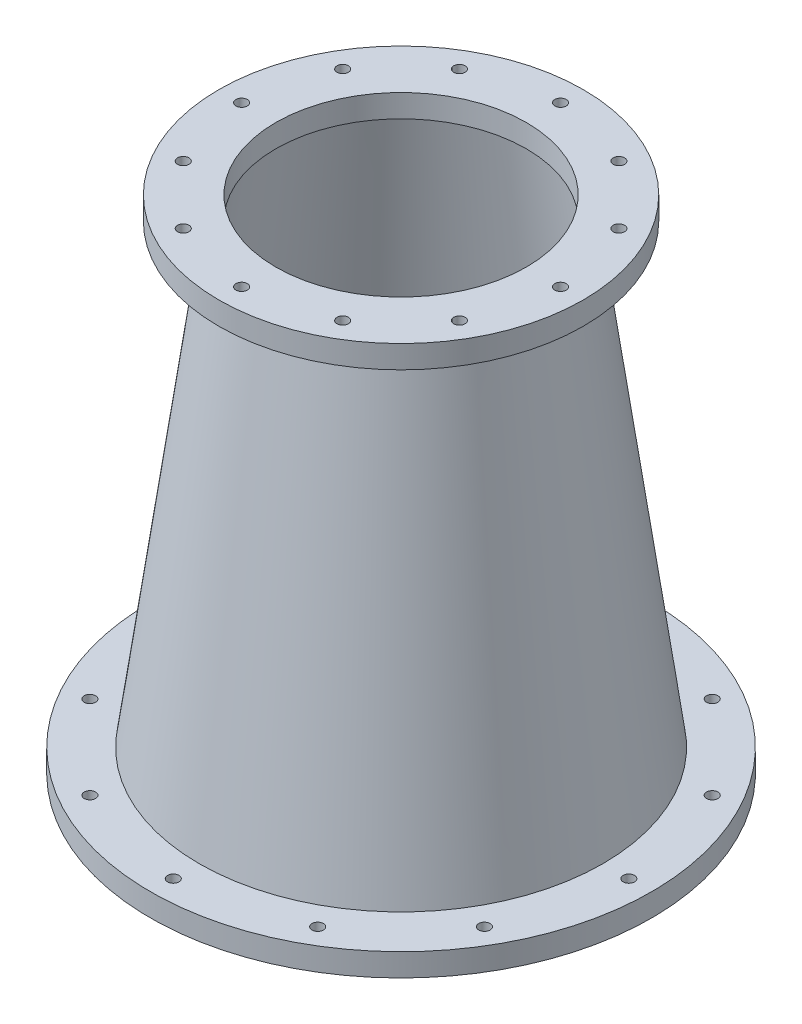
ISO-10303-21;
HEADER;
FILE_DESCRIPTION(('STEP AP214'),'2;1');
FILE_NAME('part.step','',(''),(''),'','','');
FILE_SCHEMA(('AUTOMOTIVE_DESIGN { 1 0 10303 214 1 1 1 1 }'));
ENDSEC;
DATA;
#1=APPLICATION_CONTEXT('core data for automotive mechanical design processes');
#2=APPLICATION_PROTOCOL_DEFINITION('international standard','automotive_design',2000,#1);
#3=PRODUCT_CONTEXT('',#1,'mechanical');
#4=PRODUCT('Part','Part','',(#3));
#5=PRODUCT_RELATED_PRODUCT_CATEGORY('part','',(#4));
#6=PRODUCT_DEFINITION_FORMATION('','',#4);
#7=PRODUCT_DEFINITION_CONTEXT('part definition',#1,'design');
#8=PRODUCT_DEFINITION('design','',#6,#7);
#9=PRODUCT_DEFINITION_SHAPE('','',#8);
#10=(LENGTH_UNIT() NAMED_UNIT(*) SI_UNIT(.MILLI.,.METRE.));
#11=(NAMED_UNIT(*) PLANE_ANGLE_UNIT() SI_UNIT($,.RADIAN.));
#12=(NAMED_UNIT(*) SI_UNIT($,.STERADIAN.) SOLID_ANGLE_UNIT());
#13=UNCERTAINTY_MEASURE_WITH_UNIT(LENGTH_MEASURE(1.E-05),#10,'distance_accuracy_value','');
#14=(GEOMETRIC_REPRESENTATION_CONTEXT(3) GLOBAL_UNCERTAINTY_ASSIGNED_CONTEXT((#13)) GLOBAL_UNIT_ASSIGNED_CONTEXT((#10,
#11,#12)) REPRESENTATION_CONTEXT('',''));
#15=CARTESIAN_POINT('',(0.,0.,0.));
#16=DIRECTION('',(0.,0.,1.));
#17=DIRECTION('',(1.,0.,0.));
#18=AXIS2_PLACEMENT_3D('',#15,#16,#17);
#19=CARTESIAN_POINT('',(0.,0.,0.));
#20=DIRECTION('',(0.,-1.,0.));
#21=DIRECTION('',(0.,0.,-1.));
#22=AXIS2_PLACEMENT_3D('',#19,#20,#21);
#23=CONICAL_SURFACE('',#22,114.3,0.135527713985501);
#24=CARTESIAN_POINT('',(0.,266.7,0.));
#25=DIRECTION('',(0.,1.,0.));
#26=DIRECTION('',(0.,0.,1.));
#27=AXIS2_PLACEMENT_3D('',#24,#25,#26);
#28=CIRCLE('',#27,77.9318181818182);
#29=CARTESIAN_POINT('',(0.,266.7,77.9318181818182));
#30=VERTEX_POINT('',#29);
#31=EDGE_CURVE('E309',#30,#30,#28,.T.);
#32=ORIENTED_EDGE('',*,*,#31,.F.);
#33=EDGE_LOOP('',(#32));
#34=FACE_BOUND('',#33,.T.);
#35=CARTESIAN_POINT('',(0.,12.7,0.));
#36=DIRECTION('',(0.,-1.,0.));
#37=DIRECTION('',(0.,0.,-1.));
#38=AXIS2_PLACEMENT_3D('',#35,#36,#37);
#39=CIRCLE('',#38,112.568181818182);
#40=CARTESIAN_POINT('',(0.,12.7,-112.568181818182));
#41=VERTEX_POINT('',#40);
#42=EDGE_CURVE('E11',#41,#41,#39,.T.);
#43=ORIENTED_EDGE('',*,*,#42,.F.);
#44=EDGE_LOOP('',(#43));
#45=FACE_BOUND('',#44,.T.);
#46=ADVANCED_FACE('F295',(#34,#45),#23,.T.);
#47=CARTESIAN_POINT('',(0.,279.4,0.));
#48=DIRECTION('',(0.,-1.,0.));
#49=DIRECTION('',(0.,0.,-1.));
#50=AXIS2_PLACEMENT_3D('',#47,#48,#49);
#51=CONICAL_SURFACE('',#50,69.85,0.135527713985501);
#52=CARTESIAN_POINT('',(0.,0.,0.));
#53=DIRECTION('',(0.,1.,0.));
#54=DIRECTION('',(0.,0.,1.));
#55=AXIS2_PLACEMENT_3D('',#52,#53,#54);
#56=CIRCLE('',#55,107.95);
#57=CARTESIAN_POINT('',(0.,0.,107.95));
#58=VERTEX_POINT('',#57);
#59=EDGE_CURVE('E321',#58,#58,#56,.T.);
#60=ORIENTED_EDGE('',*,*,#59,.F.);
#61=EDGE_LOOP('',(#60));
#62=FACE_BOUND('',#61,.T.);
#63=CARTESIAN_POINT('',(0.,266.7,0.));
#64=DIRECTION('',(0.,1.,0.));
#65=DIRECTION('',(0.,0.,1.));
#66=AXIS2_PLACEMENT_3D('',#63,#64,#65);
#67=CIRCLE('',#66,71.5818181818182);
#68=CARTESIAN_POINT('',(0.,266.7,71.5818181818182));
#69=VERTEX_POINT('',#68);
#70=EDGE_CURVE('E303',#69,#69,#67,.F.);
#71=ORIENTED_EDGE('',*,*,#70,.F.);
#72=EDGE_LOOP('',(#71));
#73=FACE_BOUND('',#72,.T.);
#74=ADVANCED_FACE('F591',(#62,#73),#51,.F.);
#75=CARTESIAN_POINT('',(107.95,0.,0.));
#76=DIRECTION('',(0.,1.,0.));
#77=DIRECTION('',(0.,0.,1.));
#78=AXIS2_PLACEMENT_3D('',#75,#76,#77);
#79=PLANE('',#78);
#80=ORIENTED_EDGE('',*,*,#59,.T.);
#81=EDGE_LOOP('',(#80));
#82=FACE_BOUND('',#81,.T.);
#83=CARTESIAN_POINT('',(0.,0.,-127.));
#84=DIRECTION('',(0.,-1.,0.));
#85=DIRECTION('',(0.,0.,-1.));
#86=AXIS2_PLACEMENT_3D('',#83,#84,#85);
#87=CIRCLE('',#86,3.175);
#88=CARTESIAN_POINT('',(0.,0.,-130.175));
#89=VERTEX_POINT('',#88);
#90=EDGE_CURVE('E568',#89,#89,#87,.T.);
#91=ORIENTED_EDGE('',*,*,#90,.F.);
#92=EDGE_LOOP('',(#91));
#93=FACE_BOUND('',#92,.T.);
#94=CARTESIAN_POINT('',(63.4999999999991,0.,-109.98522628062));
#95=DIRECTION('',(0.,-1.,0.));
#96=DIRECTION('',(0.,0.,-1.));
#97=AXIS2_PLACEMENT_3D('',#94,#95,#96);
#98=CIRCLE('',#97,3.17500000000361);
#99=CARTESIAN_POINT('',(63.4999999999991,0.,-113.160226280624));
#100=VERTEX_POINT('',#99);
#101=EDGE_CURVE('E560',#100,#100,#98,.T.);
#102=ORIENTED_EDGE('',*,*,#101,.F.);
#103=EDGE_LOOP('',(#102));
#104=FACE_BOUND('',#103,.T.);
#105=CARTESIAN_POINT('',(109.98522628062,0.,-63.4999999999937));
#106=DIRECTION('',(0.,-1.,0.));
#107=DIRECTION('',(0.,0.,-1.));
#108=AXIS2_PLACEMENT_3D('',#105,#106,#107);
#109=CIRCLE('',#108,3.17500000000676);
#110=CARTESIAN_POINT('',(109.98522628062,0.,-66.6750000000004));
#111=VERTEX_POINT('',#110);
#112=EDGE_CURVE('E552',#111,#111,#109,.T.);
#113=ORIENTED_EDGE('',*,*,#112,.F.);
#114=EDGE_LOOP('',(#113));
#115=FACE_BOUND('',#114,.T.);
#116=CARTESIAN_POINT('',(126.999999999993,0.,7.21133768814803E-12));
#117=DIRECTION('',(0.,-1.,0.));
#118=DIRECTION('',(0.,0.,-1.));
#119=AXIS2_PLACEMENT_3D('',#116,#117,#118);
#120=CIRCLE('',#119,3.17500000001027);
#121=CARTESIAN_POINT('',(126.999999999993,0.,-3.17500000000306));
#122=VERTEX_POINT('',#121);
#123=EDGE_CURVE('E544',#122,#122,#120,.T.);
#124=ORIENTED_EDGE('',*,*,#123,.F.);
#125=EDGE_LOOP('',(#124));
#126=FACE_BOUND('',#125,.T.);
#127=CARTESIAN_POINT('',(109.985226280613,0.,63.5000000000063));
#128=DIRECTION('',(0.,-1.,0.));
#129=DIRECTION('',(0.,0.,-1.));
#130=AXIS2_PLACEMENT_3D('',#127,#128,#129);
#131=CIRCLE('',#130,3.17500000001332);
#132=CARTESIAN_POINT('',(109.985226280613,0.,60.324999999993));
#133=VERTEX_POINT('',#132);
#134=EDGE_CURVE('E536',#133,#133,#131,.T.);
#135=ORIENTED_EDGE('',*,*,#134,.F.);
#136=EDGE_LOOP('',(#135));
#137=FACE_BOUND('',#136,.T.);
#138=CARTESIAN_POINT('',(63.4999999999865,0.,109.985226280627));
#139=DIRECTION('',(0.,-1.,0.));
#140=DIRECTION('',(0.,0.,-1.));
#141=AXIS2_PLACEMENT_3D('',#138,#139,#140);
#142=CIRCLE('',#141,3.17500000001495);
#143=CARTESIAN_POINT('',(63.4999999999865,0.,106.810226280612));
#144=VERTEX_POINT('',#143);
#145=EDGE_CURVE('E528',#144,#144,#142,.T.);
#146=ORIENTED_EDGE('',*,*,#145,.F.);
#147=EDGE_LOOP('',(#146));
#148=FACE_BOUND('',#147,.T.);
#149=CARTESIAN_POINT('',(-1.43915693475977E-11,0.,127.));
#150=DIRECTION('',(0.,-1.,0.));
#151=DIRECTION('',(0.,0.,-1.));
#152=AXIS2_PLACEMENT_3D('',#149,#150,#151);
#153=CIRCLE('',#152,3.17500000001461);
#154=CARTESIAN_POINT('',(-1.43915693475977E-11,0.,123.824999999985));
#155=VERTEX_POINT('',#154);
#156=EDGE_CURVE('E520',#155,#155,#153,.T.);
#157=ORIENTED_EDGE('',*,*,#156,.F.);
#158=EDGE_LOOP('',(#157));
#159=FACE_BOUND('',#158,.T.);
#160=CARTESIAN_POINT('',(-63.5000000000135,0.,109.98522628062));
#161=DIRECTION('',(0.,-1.,0.));
#162=DIRECTION('',(0.,0.,-1.));
#163=AXIS2_PLACEMENT_3D('',#160,#161,#162);
#164=CIRCLE('',#163,3.17500000001255);
#165=CARTESIAN_POINT('',(-63.5000000000135,0.,106.810226280608));
#166=VERTEX_POINT('',#165);
#167=EDGE_CURVE('E512',#166,#166,#164,.T.);
#168=ORIENTED_EDGE('',*,*,#167,.F.);
#169=EDGE_LOOP('',(#168));
#170=FACE_BOUND('',#169,.T.);
#171=CARTESIAN_POINT('',(-109.985226280635,0.,63.4999999999937));
#172=DIRECTION('',(0.,-1.,0.));
#173=DIRECTION('',(0.,0.,-1.));
#174=AXIS2_PLACEMENT_3D('',#171,#172,#173);
#175=CIRCLE('',#174,3.17500000000911);
#176=CARTESIAN_POINT('',(-109.985226280635,0.,60.3249999999846));
#177=VERTEX_POINT('',#176);
#178=EDGE_CURVE('E504',#177,#177,#175,.T.);
#179=ORIENTED_EDGE('',*,*,#178,.F.);
#180=EDGE_LOOP('',(#179));
#181=FACE_BOUND('',#180,.T.);
#182=CARTESIAN_POINT('',(-127.000000000007,0.,-7.19578467379886E-12));
#183=DIRECTION('',(0.,-1.,0.));
#184=DIRECTION('',(0.,0.,-1.));
#185=AXIS2_PLACEMENT_3D('',#182,#183,#184);
#186=CIRCLE('',#185,3.17500000000521);
#187=CARTESIAN_POINT('',(-127.000000000007,0.,-3.1750000000124));
#188=VERTEX_POINT('',#187);
#189=EDGE_CURVE('E496',#188,#188,#186,.T.);
#190=ORIENTED_EDGE('',*,*,#189,.F.);
#191=EDGE_LOOP('',(#190));
#192=FACE_BOUND('',#191,.T.);
#193=CARTESIAN_POINT('',(-109.985226280627,0.,-63.5000000000062));
#194=DIRECTION('',(0.,-1.,0.));
#195=DIRECTION('',(0.,0.,-1.));
#196=AXIS2_PLACEMENT_3D('',#193,#194,#195);
#197=CIRCLE('',#196,3.17500000000192);
#198=CARTESIAN_POINT('',(-109.985226280627,0.,-66.6750000000082));
#199=VERTEX_POINT('',#198);
#200=EDGE_CURVE('E488',#199,#199,#197,.T.);
#201=ORIENTED_EDGE('',*,*,#200,.F.);
#202=EDGE_LOOP('',(#201));
#203=FACE_BOUND('',#202,.T.);
#204=CARTESIAN_POINT('',(-63.500000000001,0.,-109.985226280627));
#205=DIRECTION('',(0.,-1.,0.));
#206=DIRECTION('',(0.,0.,-1.));
#207=AXIS2_PLACEMENT_3D('',#204,#205,#206);
#208=CIRCLE('',#207,3.175);
#209=CARTESIAN_POINT('',(-63.500000000001,0.,-113.160226280627));
#210=VERTEX_POINT('',#209);
#211=EDGE_CURVE('E480',#210,#210,#208,.T.);
#212=ORIENTED_EDGE('',*,*,#211,.F.);
#213=EDGE_LOOP('',(#212));
#214=FACE_BOUND('',#213,.T.);
#215=CARTESIAN_POINT('',(0.,0.,0.));
#216=DIRECTION('',(0.,-1.,0.));
#217=DIRECTION('',(0.,0.,-1.));
#218=AXIS2_PLACEMENT_3D('',#215,#216,#217);
#219=CIRCLE('',#218,139.7);
#220=CARTESIAN_POINT('',(0.,0.,-139.7));
#221=VERTEX_POINT('',#220);
#222=EDGE_CURVE('E472',#221,#221,#219,.T.);
#223=ORIENTED_EDGE('',*,*,#222,.T.);
#224=EDGE_LOOP('',(#223));
#225=FACE_BOUND('',#224,.T.);
#226=ADVANCED_FACE('F587',(#82,#93,#104,#115,#126,#137,#148,#159,#170,#181,#192,#203,#214,#225),
#79,.F.);
#227=CARTESIAN_POINT('',(44.4500000000001,266.7,-76.9896583964366));
#228=DIRECTION('',(0.,1.,0.));
#229=DIRECTION('',(0.,0.,1.));
#230=AXIS2_PLACEMENT_3D('',#227,#228,#229);
#231=CYLINDRICAL_SURFACE('',#230,3.175);
#232=CARTESIAN_POINT('',(44.4500000000001,266.7,-76.9896583964366));
#233=DIRECTION('',(0.,1.,0.));
#234=DIRECTION('',(0.,0.,1.));
#235=AXIS2_PLACEMENT_3D('',#232,#233,#234);
#236=CIRCLE('',#235,3.175);
#237=CARTESIAN_POINT('',(44.4500000000001,266.7,-73.8146583964366));
#238=VERTEX_POINT('',#237);
#239=EDGE_CURVE('E462',#238,#238,#236,.T.);
#240=ORIENTED_EDGE('',*,*,#239,.F.);
#241=EDGE_LOOP('',(#240));
#242=FACE_BOUND('',#241,.T.);
#243=CARTESIAN_POINT('',(44.4500000000001,279.4,-76.9896583964366));
#244=DIRECTION('',(0.,1.,0.));
#245=DIRECTION('',(0.,0.,1.));
#246=AXIS2_PLACEMENT_3D('',#243,#244,#245);
#247=CIRCLE('',#246,3.175);
#248=CARTESIAN_POINT('',(44.4500000000001,279.4,-73.8146583964366));
#249=VERTEX_POINT('',#248);
#250=EDGE_CURVE('E339',#249,#249,#247,.T.);
#251=ORIENTED_EDGE('',*,*,#250,.T.);
#252=EDGE_LOOP('',(#251));
#253=FACE_BOUND('',#252,.T.);
#254=ADVANCED_FACE('F590',(#242,#253),#231,.F.);
#255=CARTESIAN_POINT('',(0.,266.7,-88.9));
#256=DIRECTION('',(0.,1.,0.));
#257=DIRECTION('',(0.,0.,1.));
#258=AXIS2_PLACEMENT_3D('',#255,#256,#257);
#259=CYLINDRICAL_SURFACE('',#258,3.175);
#260=CARTESIAN_POINT('',(0.,266.7,-88.9));
#261=DIRECTION('',(0.,1.,0.));
#262=DIRECTION('',(0.,0.,1.));
#263=AXIS2_PLACEMENT_3D('',#260,#261,#262);
#264=CIRCLE('',#263,3.175);
#265=CARTESIAN_POINT('',(0.,266.7,-85.725));
#266=VERTEX_POINT('',#265);
#267=EDGE_CURVE('E456',#266,#266,#264,.T.);
#268=ORIENTED_EDGE('',*,*,#267,.F.);
#269=EDGE_LOOP('',(#268));
#270=FACE_BOUND('',#269,.T.);
#271=CARTESIAN_POINT('',(0.,279.4,-88.9));
#272=DIRECTION('',(0.,1.,0.));
#273=DIRECTION('',(0.,0.,1.));
#274=AXIS2_PLACEMENT_3D('',#271,#272,#273);
#275=CIRCLE('',#274,3.175);
#276=CARTESIAN_POINT('',(0.,279.4,-85.725));
#277=VERTEX_POINT('',#276);
#278=EDGE_CURVE('E343',#277,#277,#275,.T.);
#279=ORIENTED_EDGE('',*,*,#278,.T.);
#280=EDGE_LOOP('',(#279));
#281=FACE_BOUND('',#280,.T.);
#282=ADVANCED_FACE('F688',(#270,#281),#259,.F.);
#283=CARTESIAN_POINT('',(-88.8999999999962,266.7,3.78459139752216E-12));
#284=DIRECTION('',(0.,1.,0.));
#285=DIRECTION('',(0.,0.,1.));
#286=AXIS2_PLACEMENT_3D('',#283,#284,#285);
#287=CYLINDRICAL_SURFACE('',#286,3.17500000000561);
#288=CARTESIAN_POINT('',(-88.8999999999962,266.7,3.78459139752216E-12));
#289=DIRECTION('',(0.,1.,0.));
#290=DIRECTION('',(0.,0.,1.));
#291=AXIS2_PLACEMENT_3D('',#288,#289,#290);
#292=CIRCLE('',#291,3.17500000000561);
#293=CARTESIAN_POINT('',(-88.8999999999962,266.7,3.1750000000094));
#294=VERTEX_POINT('',#293);
#295=EDGE_CURVE('E453',#294,#294,#292,.T.);
#296=ORIENTED_EDGE('',*,*,#295,.F.);
#297=EDGE_LOOP('',(#296));
#298=FACE_BOUND('',#297,.T.);
#299=CARTESIAN_POINT('',(-88.8999999999962,279.4,3.78459139752216E-12));
#300=DIRECTION('',(0.,1.,0.));
#301=DIRECTION('',(0.,0.,1.));
#302=AXIS2_PLACEMENT_3D('',#299,#300,#301);
#303=CIRCLE('',#302,3.17500000000561);
#304=CARTESIAN_POINT('',(-88.8999999999962,279.4,3.1750000000094));
#305=VERTEX_POINT('',#304);
#306=EDGE_CURVE('E347',#305,#305,#303,.T.);
#307=ORIENTED_EDGE('',*,*,#306,.T.);
#308=EDGE_LOOP('',(#307));
#309=FACE_BOUND('',#308,.T.);
#310=ADVANCED_FACE('F681',(#298,#309),#287,.F.);
#311=CARTESIAN_POINT('',(-44.4499999999929,266.7,76.9896583964385));
#312=DIRECTION('',(0.,1.,0.));
#313=DIRECTION('',(0.,0.,1.));
#314=AXIS2_PLACEMENT_3D('',#311,#312,#313);
#315=CYLINDRICAL_SURFACE('',#314,3.17500000000801);
#316=CARTESIAN_POINT('',(-44.4499999999929,266.7,76.9896583964385));
#317=DIRECTION('',(0.,1.,0.));
#318=DIRECTION('',(0.,0.,1.));
#319=AXIS2_PLACEMENT_3D('',#316,#317,#318);
#320=CIRCLE('',#319,3.17500000000801);
#321=CARTESIAN_POINT('',(-44.4499999999929,266.7,80.1646583964465));
#322=VERTEX_POINT('',#321);
#323=EDGE_CURVE('E440',#322,#322,#320,.T.);
#324=ORIENTED_EDGE('',*,*,#323,.F.);
#325=EDGE_LOOP('',(#324));
#326=FACE_BOUND('',#325,.T.);
#327=CARTESIAN_POINT('',(-44.4499999999929,279.4,76.9896583964385));
#328=DIRECTION('',(0.,1.,0.));
#329=DIRECTION('',(0.,0.,1.));
#330=AXIS2_PLACEMENT_3D('',#327,#328,#329);
#331=CIRCLE('',#330,3.17500000000801);
#332=CARTESIAN_POINT('',(-44.4499999999929,279.4,80.1646583964465));
#333=VERTEX_POINT('',#332);
#334=EDGE_CURVE('E351',#333,#333,#331,.T.);
#335=ORIENTED_EDGE('',*,*,#334,.T.);
#336=EDGE_LOOP('',(#335));
#337=FACE_BOUND('',#336,.T.);
#338=ADVANCED_FACE('F677',(#326,#337),#315,.F.);
#339=CARTESIAN_POINT('',(7.54740857495549E-12,266.7,88.9));
#340=DIRECTION('',(0.,1.,0.));
#341=DIRECTION('',(0.,0.,1.));
#342=AXIS2_PLACEMENT_3D('',#339,#340,#341);
#343=CYLINDRICAL_SURFACE('',#342,3.17500000000781);
#344=CARTESIAN_POINT('',(7.54740857495549E-12,266.7,88.9));
#345=DIRECTION('',(0.,1.,0.));
#346=DIRECTION('',(0.,0.,1.));
#347=AXIS2_PLACEMENT_3D('',#344,#345,#346);
#348=CIRCLE('',#347,3.17500000000781);
#349=CARTESIAN_POINT('',(7.54740857495549E-12,266.7,92.0750000000078));
#350=VERTEX_POINT('',#349);
#351=EDGE_CURVE('E434',#350,#350,#348,.T.);
#352=ORIENTED_EDGE('',*,*,#351,.F.);
#353=EDGE_LOOP('',(#352));
#354=FACE_BOUND('',#353,.T.);
#355=CARTESIAN_POINT('',(7.54740857495549E-12,279.4,88.9));
#356=DIRECTION('',(0.,1.,0.));
#357=DIRECTION('',(0.,0.,1.));
#358=AXIS2_PLACEMENT_3D('',#355,#356,#357);
#359=CIRCLE('',#358,3.17500000000781);
#360=CARTESIAN_POINT('',(7.54740857495549E-12,279.4,92.0750000000078));
#361=VERTEX_POINT('',#360);
#362=EDGE_CURVE('E355',#361,#361,#359,.T.);
#363=ORIENTED_EDGE('',*,*,#362,.T.);
#364=EDGE_LOOP('',(#363));
#365=FACE_BOUND('',#364,.T.);
#366=ADVANCED_FACE('F673',(#354,#365),#343,.F.);
#367=CARTESIAN_POINT('',(44.4500000000071,266.7,76.9896583964347));
#368=DIRECTION('',(0.,1.,0.));
#369=DIRECTION('',(0.,0.,1.));
#370=AXIS2_PLACEMENT_3D('',#367,#368,#369);
#371=CYLINDRICAL_SURFACE('',#370,3.17500000000672);
#372=CARTESIAN_POINT('',(44.4500000000071,266.7,76.9896583964347));
#373=DIRECTION('',(0.,1.,0.));
#374=DIRECTION('',(0.,0.,1.));
#375=AXIS2_PLACEMENT_3D('',#372,#373,#374);
#376=CIRCLE('',#375,3.17500000000672);
#377=CARTESIAN_POINT('',(44.4500000000071,266.7,80.1646583964414));
#378=VERTEX_POINT('',#377);
#379=EDGE_CURVE('E428',#378,#378,#376,.T.);
#380=ORIENTED_EDGE('',*,*,#379,.F.);
#381=EDGE_LOOP('',(#380));
#382=FACE_BOUND('',#381,.T.);
#383=CARTESIAN_POINT('',(44.4500000000071,279.4,76.9896583964347));
#384=DIRECTION('',(0.,1.,0.));
#385=DIRECTION('',(0.,0.,1.));
#386=AXIS2_PLACEMENT_3D('',#383,#384,#385);
#387=CIRCLE('',#386,3.17500000000672);
#388=CARTESIAN_POINT('',(44.4500000000071,279.4,80.1646583964414));
#389=VERTEX_POINT('',#388);
#390=EDGE_CURVE('E359',#389,#389,#387,.T.);
#391=ORIENTED_EDGE('',*,*,#390,.T.);
#392=EDGE_LOOP('',(#391));
#393=FACE_BOUND('',#392,.T.);
#394=ADVANCED_FACE('F669',(#382,#393),#371,.F.);
#395=CARTESIAN_POINT('',(76.9896583964423,266.7,44.4499999999967));
#396=DIRECTION('',(0.,1.,0.));
#397=DIRECTION('',(0.,0.,1.));
#398=AXIS2_PLACEMENT_3D('',#395,#396,#397);
#399=CYLINDRICAL_SURFACE('',#398,3.17500000000488);
#400=CARTESIAN_POINT('',(76.9896583964423,266.7,44.4499999999967));
#401=DIRECTION('',(0.,1.,0.));
#402=DIRECTION('',(0.,0.,1.));
#403=AXIS2_PLACEMENT_3D('',#400,#401,#402);
#404=CIRCLE('',#403,3.17500000000488);
#405=CARTESIAN_POINT('',(76.9896583964423,266.7,47.6250000000016));
#406=VERTEX_POINT('',#405);
#407=EDGE_CURVE('E422',#406,#406,#404,.T.);
#408=ORIENTED_EDGE('',*,*,#407,.F.);
#409=EDGE_LOOP('',(#408));
#410=FACE_BOUND('',#409,.T.);
#411=CARTESIAN_POINT('',(76.9896583964423,279.4,44.4499999999967));
#412=DIRECTION('',(0.,1.,0.));
#413=DIRECTION('',(0.,0.,1.));
#414=AXIS2_PLACEMENT_3D('',#411,#412,#413);
#415=CIRCLE('',#414,3.17500000000488);
#416=CARTESIAN_POINT('',(76.9896583964423,279.4,47.6250000000016));
#417=VERTEX_POINT('',#416);
#418=EDGE_CURVE('E363',#417,#417,#415,.T.);
#419=ORIENTED_EDGE('',*,*,#418,.T.);
#420=EDGE_LOOP('',(#419));
#421=FACE_BOUND('',#420,.T.);
#422=ADVANCED_FACE('F665',(#410,#421),#399,.F.);
#423=CARTESIAN_POINT('',(88.9000000000038,266.7,-3.77370428747774E-12));
#424=DIRECTION('',(0.,1.,0.));
#425=DIRECTION('',(0.,0.,1.));
#426=AXIS2_PLACEMENT_3D('',#423,#424,#425);
#427=CYLINDRICAL_SURFACE('',#426,3.1750000000028);
#428=CARTESIAN_POINT('',(88.9000000000038,266.7,-3.77370428747774E-12));
#429=DIRECTION('',(0.,1.,0.));
#430=DIRECTION('',(0.,0.,1.));
#431=AXIS2_PLACEMENT_3D('',#428,#429,#430);
#432=CIRCLE('',#431,3.1750000000028);
#433=CARTESIAN_POINT('',(88.9000000000038,266.7,3.17499999999903));
#434=VERTEX_POINT('',#433);
#435=EDGE_CURVE('E416',#434,#434,#432,.T.);
#436=ORIENTED_EDGE('',*,*,#435,.F.);
#437=EDGE_LOOP('',(#436));
#438=FACE_BOUND('',#437,.T.);
#439=CARTESIAN_POINT('',(88.9000000000038,279.4,-3.77370428747774E-12));
#440=DIRECTION('',(0.,1.,0.));
#441=DIRECTION('',(0.,0.,1.));
#442=AXIS2_PLACEMENT_3D('',#439,#440,#441);
#443=CIRCLE('',#442,3.1750000000028);
#444=CARTESIAN_POINT('',(88.9000000000038,279.4,3.17499999999903));
#445=VERTEX_POINT('',#444);
#446=EDGE_CURVE('E367',#445,#445,#443,.T.);
#447=ORIENTED_EDGE('',*,*,#446,.T.);
#448=EDGE_LOOP('',(#447));
#449=FACE_BOUND('',#448,.T.);
#450=ADVANCED_FACE('F661',(#438,#449),#427,.F.);
#451=CARTESIAN_POINT('',(76.9896583964385,266.7,-44.4500000000033));
#452=DIRECTION('',(0.,1.,0.));
#453=DIRECTION('',(0.,0.,1.));
#454=AXIS2_PLACEMENT_3D('',#451,#452,#453);
#455=CYLINDRICAL_SURFACE('',#454,3.17500000000106);
#456=CARTESIAN_POINT('',(76.9896583964385,266.7,-44.4500000000033));
#457=DIRECTION('',(0.,1.,0.));
#458=DIRECTION('',(0.,0.,1.));
#459=AXIS2_PLACEMENT_3D('',#456,#457,#458);
#460=CIRCLE('',#459,3.17500000000106);
#461=CARTESIAN_POINT('',(76.9896583964385,266.7,-41.2750000000022));
#462=VERTEX_POINT('',#461);
#463=EDGE_CURVE('E410',#462,#462,#460,.T.);
#464=ORIENTED_EDGE('',*,*,#463,.F.);
#465=EDGE_LOOP('',(#464));
#466=FACE_BOUND('',#465,.T.);
#467=CARTESIAN_POINT('',(76.9896583964385,279.4,-44.4500000000033));
#468=DIRECTION('',(0.,1.,0.));
#469=DIRECTION('',(0.,0.,1.));
#470=AXIS2_PLACEMENT_3D('',#467,#468,#469);
#471=CIRCLE('',#470,3.17500000000106);
#472=CARTESIAN_POINT('',(76.9896583964385,279.4,-41.2750000000022));
#473=VERTEX_POINT('',#472);
#474=EDGE_CURVE('E371',#473,#473,#471,.T.);
#475=ORIENTED_EDGE('',*,*,#474,.T.);
#476=EDGE_LOOP('',(#475));
#477=FACE_BOUND('',#476,.T.);
#478=ADVANCED_FACE('F657',(#466,#477),#455,.F.);
#479=CARTESIAN_POINT('',(-44.4499999999995,266.7,-76.9896583964347));
#480=DIRECTION('',(0.,1.,0.));
#481=DIRECTION('',(0.,0.,1.));
#482=AXIS2_PLACEMENT_3D('',#479,#480,#481);
#483=CYLINDRICAL_SURFACE('',#482,3.17500000000217);
#484=CARTESIAN_POINT('',(-44.4499999999995,266.7,-76.9896583964347));
#485=DIRECTION('',(0.,1.,0.));
#486=DIRECTION('',(0.,0.,1.));
#487=AXIS2_PLACEMENT_3D('',#484,#485,#486);
#488=CIRCLE('',#487,3.17500000000217);
#489=CARTESIAN_POINT('',(-44.4499999999995,266.7,-73.8146583964325));
#490=VERTEX_POINT('',#489);
#491=EDGE_CURVE('E404',#490,#490,#488,.T.);
#492=ORIENTED_EDGE('',*,*,#491,.F.);
#493=EDGE_LOOP('',(#492));
#494=FACE_BOUND('',#493,.T.);
#495=CARTESIAN_POINT('',(-44.4499999999995,279.4,-76.9896583964347));
#496=DIRECTION('',(0.,1.,0.));
#497=DIRECTION('',(0.,0.,1.));
#498=AXIS2_PLACEMENT_3D('',#495,#496,#497);
#499=CIRCLE('',#498,3.17500000000217);
#500=CARTESIAN_POINT('',(-44.4499999999995,279.4,-73.8146583964325));
#501=VERTEX_POINT('',#500);
#502=EDGE_CURVE('E375',#501,#501,#499,.T.);
#503=ORIENTED_EDGE('',*,*,#502,.T.);
#504=EDGE_LOOP('',(#503));
#505=FACE_BOUND('',#504,.T.);
#506=ADVANCED_FACE('F653',(#494,#505),#483,.F.);
#507=CARTESIAN_POINT('',(-76.9896583964347,266.7,-44.4499999999967));
#508=DIRECTION('',(0.,1.,0.));
#509=DIRECTION('',(0.,0.,1.));
#510=AXIS2_PLACEMENT_3D('',#507,#508,#509);
#511=CYLINDRICAL_SURFACE('',#510,3.17500000000382);
#512=CARTESIAN_POINT('',(-76.9896583964347,266.7,-44.4499999999967));
#513=DIRECTION('',(0.,1.,0.));
#514=DIRECTION('',(0.,0.,1.));
#515=AXIS2_PLACEMENT_3D('',#512,#513,#514);
#516=CIRCLE('',#515,3.17500000000382);
#517=CARTESIAN_POINT('',(-76.9896583964347,266.7,-41.2749999999929));
#518=VERTEX_POINT('',#517);
#519=EDGE_CURVE('E399',#518,#518,#516,.T.);
#520=ORIENTED_EDGE('',*,*,#519,.F.);
#521=EDGE_LOOP('',(#520));
#522=FACE_BOUND('',#521,.T.);
#523=CARTESIAN_POINT('',(-76.9896583964347,279.4,-44.4499999999967));
#524=DIRECTION('',(0.,1.,0.));
#525=DIRECTION('',(0.,0.,1.));
#526=AXIS2_PLACEMENT_3D('',#523,#524,#525);
#527=CIRCLE('',#526,3.17500000000382);
#528=CARTESIAN_POINT('',(-76.9896583964347,279.4,-41.2749999999929));
#529=VERTEX_POINT('',#528);
#530=EDGE_CURVE('E379',#529,#529,#527,.T.);
#531=ORIENTED_EDGE('',*,*,#530,.T.);
#532=EDGE_LOOP('',(#531));
#533=FACE_BOUND('',#532,.T.);
#534=ADVANCED_FACE('F649',(#522,#533),#511,.F.);
#535=CARTESIAN_POINT('',(-76.9896583964309,266.7,44.4500000000033));
#536=DIRECTION('',(0.,1.,0.));
#537=DIRECTION('',(0.,0.,1.));
#538=AXIS2_PLACEMENT_3D('',#535,#536,#537);
#539=CYLINDRICAL_SURFACE('',#538,3.17500000000717);
#540=CARTESIAN_POINT('',(-76.9896583964309,266.7,44.4500000000033));
#541=DIRECTION('',(0.,1.,0.));
#542=DIRECTION('',(0.,0.,1.));
#543=AXIS2_PLACEMENT_3D('',#540,#541,#542);
#544=CIRCLE('',#543,3.17500000000717);
#545=CARTESIAN_POINT('',(-76.9896583964309,266.7,47.6250000000105));
#546=VERTEX_POINT('',#545);
#547=EDGE_CURVE('E388',#546,#546,#544,.T.);
#548=ORIENTED_EDGE('',*,*,#547,.F.);
#549=EDGE_LOOP('',(#548));
#550=FACE_BOUND('',#549,.T.);
#551=CARTESIAN_POINT('',(-76.9896583964309,279.4,44.4500000000033));
#552=DIRECTION('',(0.,1.,0.));
#553=DIRECTION('',(0.,0.,1.));
#554=AXIS2_PLACEMENT_3D('',#551,#552,#553);
#555=CIRCLE('',#554,3.17500000000717);
#556=CARTESIAN_POINT('',(-76.9896583964309,279.4,47.6250000000105));
#557=VERTEX_POINT('',#556);
#558=EDGE_CURVE('E383',#557,#557,#555,.T.);
#559=ORIENTED_EDGE('',*,*,#558,.T.);
#560=EDGE_LOOP('',(#559));
#561=FACE_BOUND('',#560,.T.);
#562=ADVANCED_FACE('F645',(#550,#561),#539,.F.);
#563=CARTESIAN_POINT('',(0.,266.7,0.));
#564=DIRECTION('',(0.,1.,0.));
#565=DIRECTION('',(0.,0.,1.));
#566=AXIS2_PLACEMENT_3D('',#563,#564,#565);
#567=PLANE('',#566);
#568=ORIENTED_EDGE('',*,*,#31,.T.);
#569=EDGE_LOOP('',(#568));
#570=FACE_BOUND('',#569,.T.);
#571=ORIENTED_EDGE('',*,*,#239,.T.);
#572=EDGE_LOOP('',(#571));
#573=FACE_BOUND('',#572,.T.);
#574=ORIENTED_EDGE('',*,*,#267,.T.);
#575=EDGE_LOOP('',(#574));
#576=FACE_BOUND('',#575,.T.);
#577=ORIENTED_EDGE('',*,*,#295,.T.);
#578=EDGE_LOOP('',(#577));
#579=FACE_BOUND('',#578,.T.);
#580=ORIENTED_EDGE('',*,*,#323,.T.);
#581=EDGE_LOOP('',(#580));
#582=FACE_BOUND('',#581,.T.);
#583=ORIENTED_EDGE('',*,*,#351,.T.);
#584=EDGE_LOOP('',(#583));
#585=FACE_BOUND('',#584,.T.);
#586=ORIENTED_EDGE('',*,*,#379,.T.);
#587=EDGE_LOOP('',(#586));
#588=FACE_BOUND('',#587,.T.);
#589=ORIENTED_EDGE('',*,*,#407,.T.);
#590=EDGE_LOOP('',(#589));
#591=FACE_BOUND('',#590,.T.);
#592=ORIENTED_EDGE('',*,*,#435,.T.);
#593=EDGE_LOOP('',(#592));
#594=FACE_BOUND('',#593,.T.);
#595=ORIENTED_EDGE('',*,*,#463,.T.);
#596=EDGE_LOOP('',(#595));
#597=FACE_BOUND('',#596,.T.);
#598=ORIENTED_EDGE('',*,*,#491,.T.);
#599=EDGE_LOOP('',(#598));
#600=FACE_BOUND('',#599,.T.);
#601=ORIENTED_EDGE('',*,*,#519,.T.);
#602=EDGE_LOOP('',(#601));
#603=FACE_BOUND('',#602,.T.);
#604=ORIENTED_EDGE('',*,*,#547,.T.);
#605=EDGE_LOOP('',(#604));
#606=FACE_BOUND('',#605,.T.);
#607=CARTESIAN_POINT('',(0.,266.7,0.));
#608=DIRECTION('',(0.,1.,0.));
#609=DIRECTION('',(0.,0.,1.));
#610=AXIS2_PLACEMENT_3D('',#607,#608,#609);
#611=CIRCLE('',#610,101.6);
#612=CARTESIAN_POINT('',(0.,266.7,101.6));
#613=VERTEX_POINT('',#612);
#614=EDGE_CURVE('E325',#613,#613,#611,.T.);
#615=ORIENTED_EDGE('',*,*,#614,.F.);
#616=EDGE_LOOP('',(#615));
#617=FACE_BOUND('',#616,.T.);
#618=ADVANCED_FACE('F641',(#570,#573,#576,#579,#582,#585,#588,#591,#594,#597,#600,#603,#606,
#617),#567,.F.);
#619=CARTESIAN_POINT('',(0.,266.7,0.));
#620=DIRECTION('',(0.,1.,0.));
#621=DIRECTION('',(0.,0.,1.));
#622=AXIS2_PLACEMENT_3D('',#619,#620,#621);
#623=CYLINDRICAL_SURFACE('',#622,101.6);
#624=ORIENTED_EDGE('',*,*,#614,.T.);
#625=EDGE_LOOP('',(#624));
#626=FACE_BOUND('',#625,.T.);
#627=CARTESIAN_POINT('',(0.,279.4,0.));
#628=DIRECTION('',(0.,1.,0.));
#629=DIRECTION('',(0.,0.,1.));
#630=AXIS2_PLACEMENT_3D('',#627,#628,#629);
#631=CIRCLE('',#630,101.6);
#632=CARTESIAN_POINT('',(0.,279.4,101.6));
#633=VERTEX_POINT('',#632);
#634=EDGE_CURVE('E319',#633,#633,#631,.T.);
#635=ORIENTED_EDGE('',*,*,#634,.F.);
#636=EDGE_LOOP('',(#635));
#637=FACE_BOUND('',#636,.T.);
#638=ADVANCED_FACE('F637',(#626,#637),#623,.T.);
#639=ORIENTED_EDGE('',*,*,#70,.T.);
#640=EDGE_LOOP('',(#639));
#641=FACE_BOUND('',#640,.T.);
#642=CARTESIAN_POINT('',(0.,266.7,0.));
#643=DIRECTION('',(0.,1.,0.));
#644=DIRECTION('',(0.,0.,1.));
#645=AXIS2_PLACEMENT_3D('',#642,#643,#644);
#646=CIRCLE('',#645,69.85);
#647=CARTESIAN_POINT('',(0.,266.7,69.85));
#648=VERTEX_POINT('',#647);
#649=EDGE_CURVE('E446',#648,#648,#646,.T.);
#650=ORIENTED_EDGE('',*,*,#649,.T.);
#651=EDGE_LOOP('',(#650));
#652=FACE_BOUND('',#651,.T.);
#653=ADVANCED_FACE('F640',(#641,#652),#567,.F.);
#654=CARTESIAN_POINT('',(0.,266.7,0.));
#655=DIRECTION('',(0.,1.,0.));
#656=DIRECTION('',(0.,0.,1.));
#657=AXIS2_PLACEMENT_3D('',#654,#655,#656);
#658=CYLINDRICAL_SURFACE('',#657,69.85);
#659=ORIENTED_EDGE('',*,*,#649,.F.);
#660=EDGE_LOOP('',(#659));
#661=FACE_BOUND('',#660,.T.);
#662=CARTESIAN_POINT('',(0.,279.4,0.));
#663=DIRECTION('',(0.,1.,0.));
#664=DIRECTION('',(0.,0.,1.));
#665=AXIS2_PLACEMENT_3D('',#662,#663,#664);
#666=CIRCLE('',#665,69.85);
#667=CARTESIAN_POINT('',(0.,279.4,69.85));
#668=VERTEX_POINT('',#667);
#669=EDGE_CURVE('E316',#668,#668,#666,.T.);
#670=ORIENTED_EDGE('',*,*,#669,.T.);
#671=EDGE_LOOP('',(#670));
#672=FACE_BOUND('',#671,.T.);
#673=ADVANCED_FACE('F331',(#661,#672),#658,.F.);
#674=CARTESIAN_POINT('',(76.2,279.4,0.));
#675=DIRECTION('',(0.,-1.,0.));
#676=DIRECTION('',(0.,0.,-1.));
#677=AXIS2_PLACEMENT_3D('',#674,#675,#676);
#678=PLANE('',#677);
#679=ORIENTED_EDGE('',*,*,#669,.F.);
#680=EDGE_LOOP('',(#679));
#681=FACE_BOUND('',#680,.T.);
#682=ORIENTED_EDGE('',*,*,#250,.F.);
#683=EDGE_LOOP('',(#682));
#684=FACE_BOUND('',#683,.T.);
#685=ORIENTED_EDGE('',*,*,#278,.F.);
#686=EDGE_LOOP('',(#685));
#687=FACE_BOUND('',#686,.T.);
#688=ORIENTED_EDGE('',*,*,#306,.F.);
#689=EDGE_LOOP('',(#688));
#690=FACE_BOUND('',#689,.T.);
#691=ORIENTED_EDGE('',*,*,#334,.F.);
#692=EDGE_LOOP('',(#691));
#693=FACE_BOUND('',#692,.T.);
#694=ORIENTED_EDGE('',*,*,#362,.F.);
#695=EDGE_LOOP('',(#694));
#696=FACE_BOUND('',#695,.T.);
#697=ORIENTED_EDGE('',*,*,#390,.F.);
#698=EDGE_LOOP('',(#697));
#699=FACE_BOUND('',#698,.T.);
#700=ORIENTED_EDGE('',*,*,#418,.F.);
#701=EDGE_LOOP('',(#700));
#702=FACE_BOUND('',#701,.T.);
#703=ORIENTED_EDGE('',*,*,#446,.F.);
#704=EDGE_LOOP('',(#703));
#705=FACE_BOUND('',#704,.T.);
#706=ORIENTED_EDGE('',*,*,#474,.F.);
#707=EDGE_LOOP('',(#706));
#708=FACE_BOUND('',#707,.T.);
#709=ORIENTED_EDGE('',*,*,#502,.F.);
#710=EDGE_LOOP('',(#709));
#711=FACE_BOUND('',#710,.T.);
#712=ORIENTED_EDGE('',*,*,#530,.F.);
#713=EDGE_LOOP('',(#712));
#714=FACE_BOUND('',#713,.T.);
#715=ORIENTED_EDGE('',*,*,#558,.F.);
#716=EDGE_LOOP('',(#715));
#717=FACE_BOUND('',#716,.T.);
#718=ORIENTED_EDGE('',*,*,#634,.T.);
#719=EDGE_LOOP('',(#718));
#720=FACE_BOUND('',#719,.T.);
#721=ADVANCED_FACE('F297',(#681,#684,#687,#690,#693,#696,#699,#702,#705,#708,#711,#714,#717,
#720),#678,.F.);
#722=CARTESIAN_POINT('',(0.,12.7,0.));
#723=DIRECTION('',(0.,-1.,0.));
#724=DIRECTION('',(0.,0.,-1.));
#725=AXIS2_PLACEMENT_3D('',#722,#723,#724);
#726=CYLINDRICAL_SURFACE('',#725,139.7);
#727=CARTESIAN_POINT('',(0.,12.7,0.));
#728=DIRECTION('',(0.,-1.,0.));
#729=DIRECTION('',(0.,0.,-1.));
#730=AXIS2_PLACEMENT_3D('',#727,#728,#729);
#731=CIRCLE('',#730,139.7);
#732=CARTESIAN_POINT('',(0.,12.7,-139.7));
#733=VERTEX_POINT('',#732);
#734=EDGE_CURVE('E468',#733,#733,#731,.T.);
#735=ORIENTED_EDGE('',*,*,#734,.T.);
#736=EDGE_LOOP('',(#735));
#737=FACE_BOUND('',#736,.T.);
#738=ORIENTED_EDGE('',*,*,#222,.F.);
#739=EDGE_LOOP('',(#738));
#740=FACE_BOUND('',#739,.T.);
#741=ADVANCED_FACE('F335',(#737,#740),#726,.T.);
#742=CARTESIAN_POINT('',(0.,12.7,0.));
#743=DIRECTION('',(0.,-1.,0.));
#744=DIRECTION('',(0.,0.,-1.));
#745=AXIS2_PLACEMENT_3D('',#742,#743,#744);
#746=PLANE('',#745);
#747=ORIENTED_EDGE('',*,*,#42,.T.);
#748=EDGE_LOOP('',(#747));
#749=FACE_BOUND('',#748,.T.);
#750=CARTESIAN_POINT('',(0.,12.7,-127.));
#751=DIRECTION('',(0.,-1.,0.));
#752=DIRECTION('',(0.,0.,-1.));
#753=AXIS2_PLACEMENT_3D('',#750,#751,#752);
#754=CIRCLE('',#753,3.175);
#755=CARTESIAN_POINT('',(0.,12.7,-130.175));
#756=VERTEX_POINT('',#755);
#757=EDGE_CURVE('E564',#756,#756,#754,.T.);
#758=ORIENTED_EDGE('',*,*,#757,.T.);
#759=EDGE_LOOP('',(#758));
#760=FACE_BOUND('',#759,.T.);
#761=CARTESIAN_POINT('',(63.4999999999991,12.7,-109.98522628062));
#762=DIRECTION('',(0.,-1.,0.));
#763=DIRECTION('',(0.,0.,-1.));
#764=AXIS2_PLACEMENT_3D('',#761,#762,#763);
#765=CIRCLE('',#764,3.17500000000361);
#766=CARTESIAN_POINT('',(63.4999999999991,12.7,-113.160226280624));
#767=VERTEX_POINT('',#766);
#768=EDGE_CURVE('E556',#767,#767,#765,.T.);
#769=ORIENTED_EDGE('',*,*,#768,.T.);
#770=EDGE_LOOP('',(#769));
#771=FACE_BOUND('',#770,.T.);
#772=CARTESIAN_POINT('',(109.98522628062,12.7,-63.4999999999937));
#773=DIRECTION('',(0.,-1.,0.));
#774=DIRECTION('',(0.,0.,-1.));
#775=AXIS2_PLACEMENT_3D('',#772,#773,#774);
#776=CIRCLE('',#775,3.17500000000676);
#777=CARTESIAN_POINT('',(109.98522628062,12.7,-66.6750000000004));
#778=VERTEX_POINT('',#777);
#779=EDGE_CURVE('E548',#778,#778,#776,.T.);
#780=ORIENTED_EDGE('',*,*,#779,.T.);
#781=EDGE_LOOP('',(#780));
#782=FACE_BOUND('',#781,.T.);
#783=CARTESIAN_POINT('',(126.999999999993,12.7,7.21133768814803E-12));
#784=DIRECTION('',(0.,-1.,0.));
#785=DIRECTION('',(0.,0.,-1.));
#786=AXIS2_PLACEMENT_3D('',#783,#784,#785);
#787=CIRCLE('',#786,3.17500000001027);
#788=CARTESIAN_POINT('',(126.999999999993,12.7,-3.17500000000306));
#789=VERTEX_POINT('',#788);
#790=EDGE_CURVE('E540',#789,#789,#787,.T.);
#791=ORIENTED_EDGE('',*,*,#790,.T.);
#792=EDGE_LOOP('',(#791));
#793=FACE_BOUND('',#792,.T.);
#794=CARTESIAN_POINT('',(109.985226280613,12.7,63.5000000000063));
#795=DIRECTION('',(0.,-1.,0.));
#796=DIRECTION('',(0.,0.,-1.));
#797=AXIS2_PLACEMENT_3D('',#794,#795,#796);
#798=CIRCLE('',#797,3.17500000001332);
#799=CARTESIAN_POINT('',(109.985226280613,12.7,60.324999999993));
#800=VERTEX_POINT('',#799);
#801=EDGE_CURVE('E532',#800,#800,#798,.T.);
#802=ORIENTED_EDGE('',*,*,#801,.T.);
#803=EDGE_LOOP('',(#802));
#804=FACE_BOUND('',#803,.T.);
#805=CARTESIAN_POINT('',(63.4999999999865,12.7,109.985226280627));
#806=DIRECTION('',(0.,-1.,0.));
#807=DIRECTION('',(0.,0.,-1.));
#808=AXIS2_PLACEMENT_3D('',#805,#806,#807);
#809=CIRCLE('',#808,3.17500000001495);
#810=CARTESIAN_POINT('',(63.4999999999865,12.7,106.810226280612));
#811=VERTEX_POINT('',#810);
#812=EDGE_CURVE('E524',#811,#811,#809,.T.);
#813=ORIENTED_EDGE('',*,*,#812,.T.);
#814=EDGE_LOOP('',(#813));
#815=FACE_BOUND('',#814,.T.);
#816=CARTESIAN_POINT('',(-1.43915693475977E-11,12.7,127.));
#817=DIRECTION('',(0.,-1.,0.));
#818=DIRECTION('',(0.,0.,-1.));
#819=AXIS2_PLACEMENT_3D('',#816,#817,#818);
#820=CIRCLE('',#819,3.17500000001461);
#821=CARTESIAN_POINT('',(-1.43915693475977E-11,12.7,123.824999999985));
#822=VERTEX_POINT('',#821);
#823=EDGE_CURVE('E516',#822,#822,#820,.T.);
#824=ORIENTED_EDGE('',*,*,#823,.T.);
#825=EDGE_LOOP('',(#824));
#826=FACE_BOUND('',#825,.T.);
#827=CARTESIAN_POINT('',(-63.5000000000135,12.7,109.98522628062));
#828=DIRECTION('',(0.,-1.,0.));
#829=DIRECTION('',(0.,0.,-1.));
#830=AXIS2_PLACEMENT_3D('',#827,#828,#829);
#831=CIRCLE('',#830,3.17500000001255);
#832=CARTESIAN_POINT('',(-63.5000000000135,12.7,106.810226280608));
#833=VERTEX_POINT('',#832);
#834=EDGE_CURVE('E508',#833,#833,#831,.T.);
#835=ORIENTED_EDGE('',*,*,#834,.T.);
#836=EDGE_LOOP('',(#835));
#837=FACE_BOUND('',#836,.T.);
#838=CARTESIAN_POINT('',(-109.985226280635,12.7,63.4999999999937));
#839=DIRECTION('',(0.,-1.,0.));
#840=DIRECTION('',(0.,0.,-1.));
#841=AXIS2_PLACEMENT_3D('',#838,#839,#840);
#842=CIRCLE('',#841,3.17500000000911);
#843=CARTESIAN_POINT('',(-109.985226280635,12.7,60.3249999999846));
#844=VERTEX_POINT('',#843);
#845=EDGE_CURVE('E500',#844,#844,#842,.T.);
#846=ORIENTED_EDGE('',*,*,#845,.T.);
#847=EDGE_LOOP('',(#846));
#848=FACE_BOUND('',#847,.T.);
#849=CARTESIAN_POINT('',(-127.000000000007,12.7,-7.19578467379886E-12));
#850=DIRECTION('',(0.,-1.,0.));
#851=DIRECTION('',(0.,0.,-1.));
#852=AXIS2_PLACEMENT_3D('',#849,#850,#851);
#853=CIRCLE('',#852,3.17500000000521);
#854=CARTESIAN_POINT('',(-127.000000000007,12.7,-3.1750000000124));
#855=VERTEX_POINT('',#854);
#856=EDGE_CURVE('E492',#855,#855,#853,.T.);
#857=ORIENTED_EDGE('',*,*,#856,.T.);
#858=EDGE_LOOP('',(#857));
#859=FACE_BOUND('',#858,.T.);
#860=CARTESIAN_POINT('',(-109.985226280627,12.7,-63.5000000000062));
#861=DIRECTION('',(0.,-1.,0.));
#862=DIRECTION('',(0.,0.,-1.));
#863=AXIS2_PLACEMENT_3D('',#860,#861,#862);
#864=CIRCLE('',#863,3.17500000000192);
#865=CARTESIAN_POINT('',(-109.985226280627,12.7,-66.6750000000082));
#866=VERTEX_POINT('',#865);
#867=EDGE_CURVE('E484',#866,#866,#864,.T.);
#868=ORIENTED_EDGE('',*,*,#867,.T.);
#869=EDGE_LOOP('',(#868));
#870=FACE_BOUND('',#869,.T.);
#871=CARTESIAN_POINT('',(-63.500000000001,12.7,-109.985226280627));
#872=DIRECTION('',(0.,-1.,0.));
#873=DIRECTION('',(0.,0.,-1.));
#874=AXIS2_PLACEMENT_3D('',#871,#872,#873);
#875=CIRCLE('',#874,3.175);
#876=CARTESIAN_POINT('',(-63.500000000001,12.7,-113.160226280627));
#877=VERTEX_POINT('',#876);
#878=EDGE_CURVE('E476',#877,#877,#875,.T.);
#879=ORIENTED_EDGE('',*,*,#878,.T.);
#880=EDGE_LOOP('',(#879));
#881=FACE_BOUND('',#880,.T.);
#882=ORIENTED_EDGE('',*,*,#734,.F.);
#883=EDGE_LOOP('',(#882));
#884=FACE_BOUND('',#883,.T.);
#885=ADVANCED_FACE('F577',(#749,#760,#771,#782,#793,#804,#815,#826,#837,#848,#859,#870,#881,
#884),#746,.F.);
#886=CARTESIAN_POINT('',(-63.500000000001,12.7,-109.985226280627));
#887=DIRECTION('',(0.,-1.,0.));
#888=DIRECTION('',(0.,0.,-1.));
#889=AXIS2_PLACEMENT_3D('',#886,#887,#888);
#890=CYLINDRICAL_SURFACE('',#889,3.175);
#891=ORIENTED_EDGE('',*,*,#878,.F.);
#892=EDGE_LOOP('',(#891));
#893=FACE_BOUND('',#892,.T.);
#894=ORIENTED_EDGE('',*,*,#211,.T.);
#895=EDGE_LOOP('',(#894));
#896=FACE_BOUND('',#895,.T.);
#897=ADVANCED_FACE('F624',(#893,#896),#890,.F.);
#898=CARTESIAN_POINT('',(-109.985226280627,12.7,-63.5000000000062));
#899=DIRECTION('',(0.,-1.,0.));
#900=DIRECTION('',(0.,0.,-1.));
#901=AXIS2_PLACEMENT_3D('',#898,#899,#900);
#902=CYLINDRICAL_SURFACE('',#901,3.17500000000192);
#903=ORIENTED_EDGE('',*,*,#867,.F.);
#904=EDGE_LOOP('',(#903));
#905=FACE_BOUND('',#904,.T.);
#906=ORIENTED_EDGE('',*,*,#200,.T.);
#907=EDGE_LOOP('',(#906));
#908=FACE_BOUND('',#907,.T.);
#909=ADVANCED_FACE('F819',(#905,#908),#902,.F.);
#910=CARTESIAN_POINT('',(-127.000000000007,12.7,-7.19578467379886E-12));
#911=DIRECTION('',(0.,-1.,0.));
#912=DIRECTION('',(0.,0.,-1.));
#913=AXIS2_PLACEMENT_3D('',#910,#911,#912);
#914=CYLINDRICAL_SURFACE('',#913,3.17500000000521);
#915=ORIENTED_EDGE('',*,*,#856,.F.);
#916=EDGE_LOOP('',(#915));
#917=FACE_BOUND('',#916,.T.);
#918=ORIENTED_EDGE('',*,*,#189,.T.);
#919=EDGE_LOOP('',(#918));
#920=FACE_BOUND('',#919,.T.);
#921=ADVANCED_FACE('F829',(#917,#920),#914,.F.);
#922=CARTESIAN_POINT('',(-109.985226280635,12.7,63.4999999999937));
#923=DIRECTION('',(0.,-1.,0.));
#924=DIRECTION('',(0.,0.,-1.));
#925=AXIS2_PLACEMENT_3D('',#922,#923,#924);
#926=CYLINDRICAL_SURFACE('',#925,3.17500000000911);
#927=ORIENTED_EDGE('',*,*,#845,.F.);
#928=EDGE_LOOP('',(#927));
#929=FACE_BOUND('',#928,.T.);
#930=ORIENTED_EDGE('',*,*,#178,.T.);
#931=EDGE_LOOP('',(#930));
#932=FACE_BOUND('',#931,.T.);
#933=ADVANCED_FACE('F839',(#929,#932),#926,.F.);
#934=CARTESIAN_POINT('',(-63.5000000000135,12.7,109.98522628062));
#935=DIRECTION('',(0.,-1.,0.));
#936=DIRECTION('',(0.,0.,-1.));
#937=AXIS2_PLACEMENT_3D('',#934,#935,#936);
#938=CYLINDRICAL_SURFACE('',#937,3.17500000001255);
#939=ORIENTED_EDGE('',*,*,#834,.F.);
#940=EDGE_LOOP('',(#939));
#941=FACE_BOUND('',#940,.T.);
#942=ORIENTED_EDGE('',*,*,#167,.T.);
#943=EDGE_LOOP('',(#942));
#944=FACE_BOUND('',#943,.T.);
#945=ADVANCED_FACE('F849',(#941,#944),#938,.F.);
#946=CARTESIAN_POINT('',(-1.43915693475977E-11,12.7,127.));
#947=DIRECTION('',(0.,-1.,0.));
#948=DIRECTION('',(0.,0.,-1.));
#949=AXIS2_PLACEMENT_3D('',#946,#947,#948);
#950=CYLINDRICAL_SURFACE('',#949,3.17500000001461);
#951=ORIENTED_EDGE('',*,*,#823,.F.);
#952=EDGE_LOOP('',(#951));
#953=FACE_BOUND('',#952,.T.);
#954=ORIENTED_EDGE('',*,*,#156,.T.);
#955=EDGE_LOOP('',(#954));
#956=FACE_BOUND('',#955,.T.);
#957=ADVANCED_FACE('F859',(#953,#956),#950,.F.);
#958=CARTESIAN_POINT('',(63.4999999999865,12.7,109.985226280627));
#959=DIRECTION('',(0.,-1.,0.));
#960=DIRECTION('',(0.,0.,-1.));
#961=AXIS2_PLACEMENT_3D('',#958,#959,#960);
#962=CYLINDRICAL_SURFACE('',#961,3.17500000001495);
#963=ORIENTED_EDGE('',*,*,#812,.F.);
#964=EDGE_LOOP('',(#963));
#965=FACE_BOUND('',#964,.T.);
#966=ORIENTED_EDGE('',*,*,#145,.T.);
#967=EDGE_LOOP('',(#966));
#968=FACE_BOUND('',#967,.T.);
#969=ADVANCED_FACE('F869',(#965,#968),#962,.F.);
#970=CARTESIAN_POINT('',(109.985226280613,12.7,63.5000000000063));
#971=DIRECTION('',(0.,-1.,0.));
#972=DIRECTION('',(0.,0.,-1.));
#973=AXIS2_PLACEMENT_3D('',#970,#971,#972);
#974=CYLINDRICAL_SURFACE('',#973,3.17500000001332);
#975=ORIENTED_EDGE('',*,*,#801,.F.);
#976=EDGE_LOOP('',(#975));
#977=FACE_BOUND('',#976,.T.);
#978=ORIENTED_EDGE('',*,*,#134,.T.);
#979=EDGE_LOOP('',(#978));
#980=FACE_BOUND('',#979,.T.);
#981=ADVANCED_FACE('F879',(#977,#980),#974,.F.);
#982=CARTESIAN_POINT('',(126.999999999993,12.7,7.21133768814803E-12));
#983=DIRECTION('',(0.,-1.,0.));
#984=DIRECTION('',(0.,0.,-1.));
#985=AXIS2_PLACEMENT_3D('',#982,#983,#984);
#986=CYLINDRICAL_SURFACE('',#985,3.17500000001027);
#987=ORIENTED_EDGE('',*,*,#790,.F.);
#988=EDGE_LOOP('',(#987));
#989=FACE_BOUND('',#988,.T.);
#990=ORIENTED_EDGE('',*,*,#123,.T.);
#991=EDGE_LOOP('',(#990));
#992=FACE_BOUND('',#991,.T.);
#993=ADVANCED_FACE('F889',(#989,#992),#986,.F.);
#994=CARTESIAN_POINT('',(109.98522628062,12.7,-63.4999999999937));
#995=DIRECTION('',(0.,-1.,0.));
#996=DIRECTION('',(0.,0.,-1.));
#997=AXIS2_PLACEMENT_3D('',#994,#995,#996);
#998=CYLINDRICAL_SURFACE('',#997,3.17500000000676);
#999=ORIENTED_EDGE('',*,*,#779,.F.);
#1000=EDGE_LOOP('',(#999));
#1001=FACE_BOUND('',#1000,.T.);
#1002=ORIENTED_EDGE('',*,*,#112,.T.);
#1003=EDGE_LOOP('',(#1002));
#1004=FACE_BOUND('',#1003,.T.);
#1005=ADVANCED_FACE('F899',(#1001,#1004),#998,.F.);
#1006=CARTESIAN_POINT('',(63.4999999999991,12.7,-109.98522628062));
#1007=DIRECTION('',(0.,-1.,0.));
#1008=DIRECTION('',(0.,0.,-1.));
#1009=AXIS2_PLACEMENT_3D('',#1006,#1007,#1008);
#1010=CYLINDRICAL_SURFACE('',#1009,3.17500000000361);
#1011=ORIENTED_EDGE('',*,*,#768,.F.);
#1012=EDGE_LOOP('',(#1011));
#1013=FACE_BOUND('',#1012,.T.);
#1014=ORIENTED_EDGE('',*,*,#101,.T.);
#1015=EDGE_LOOP('',(#1014));
#1016=FACE_BOUND('',#1015,.T.);
#1017=ADVANCED_FACE('F583',(#1013,#1016),#1010,.F.);
#1018=CARTESIAN_POINT('',(0.,12.7,-127.));
#1019=DIRECTION('',(0.,-1.,0.));
#1020=DIRECTION('',(0.,0.,-1.));
#1021=AXIS2_PLACEMENT_3D('',#1018,#1019,#1020);
#1022=CYLINDRICAL_SURFACE('',#1021,3.175);
#1023=ORIENTED_EDGE('',*,*,#757,.F.);
#1024=EDGE_LOOP('',(#1023));
#1025=FACE_BOUND('',#1024,.T.);
#1026=ORIENTED_EDGE('',*,*,#90,.T.);
#1027=EDGE_LOOP('',(#1026));
#1028=FACE_BOUND('',#1027,.T.);
#1029=ADVANCED_FACE('F580',(#1025,#1028),#1022,.F.);
#1030=CLOSED_SHELL('',(#46,#74,#226,#254,#282,#310,#338,#366,#394,#422,#450,#478,#506,#534,#562,
#618,#638,#653,#673,#721,#741,#885,#897,#909,#921,#933,#945,#957,#969,#981,#993,#1005,#1017,#1029));
#1031=MANIFOLD_SOLID_BREP('B2',#1030);
#1032=ADVANCED_BREP_SHAPE_REPRESENTATION('',(#18,#1031),#14);
#1033=SHAPE_DEFINITION_REPRESENTATION(#9,#1032);
ENDSEC;
END-ISO-10303-21;
